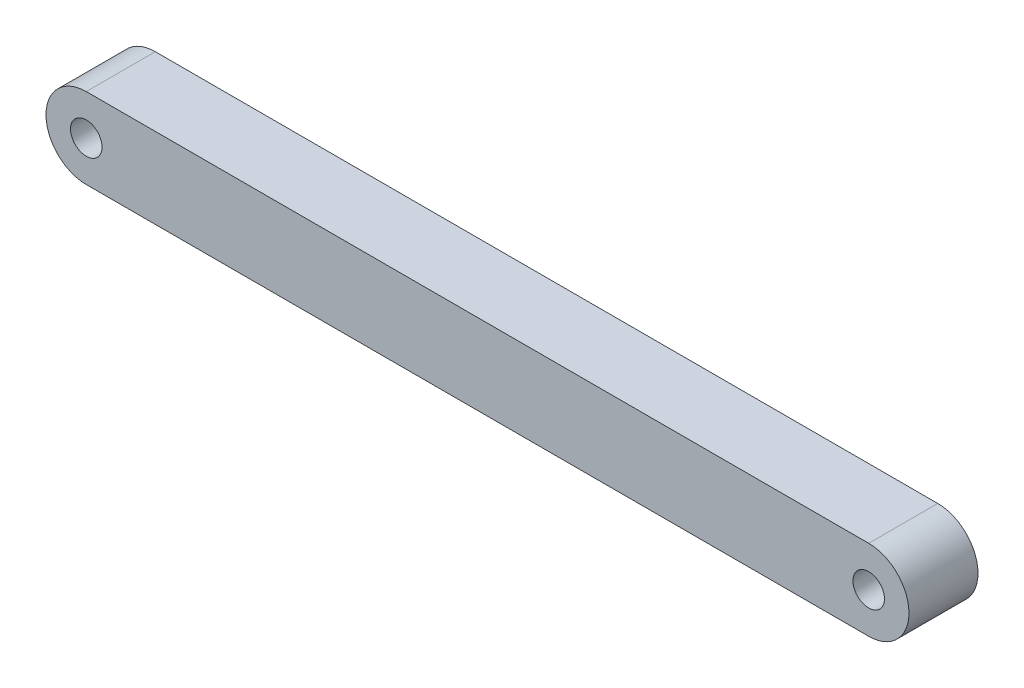
ISO-10303-21;
HEADER;
FILE_DESCRIPTION(('STEP AP214'),'2;1');
FILE_NAME('part.step','',(''),(''),'','','');
FILE_SCHEMA(('AUTOMOTIVE_DESIGN { 1 0 10303 214 1 1 1 1 }'));
ENDSEC;
DATA;
#1=APPLICATION_CONTEXT('core data for automotive mechanical design processes');
#2=APPLICATION_PROTOCOL_DEFINITION('international standard','automotive_design',2000,#1);
#3=PRODUCT_CONTEXT('',#1,'mechanical');
#4=PRODUCT('Part','Part','',(#3));
#5=PRODUCT_RELATED_PRODUCT_CATEGORY('part','',(#4));
#6=PRODUCT_DEFINITION_FORMATION('','',#4);
#7=PRODUCT_DEFINITION_CONTEXT('part definition',#1,'design');
#8=PRODUCT_DEFINITION('design','',#6,#7);
#9=PRODUCT_DEFINITION_SHAPE('','',#8);
#10=(LENGTH_UNIT() NAMED_UNIT(*) SI_UNIT(.MILLI.,.METRE.));
#11=(NAMED_UNIT(*) PLANE_ANGLE_UNIT() SI_UNIT($,.RADIAN.));
#12=(NAMED_UNIT(*) SI_UNIT($,.STERADIAN.) SOLID_ANGLE_UNIT());
#13=UNCERTAINTY_MEASURE_WITH_UNIT(LENGTH_MEASURE(1.E-05),#10,'distance_accuracy_value','');
#14=(GEOMETRIC_REPRESENTATION_CONTEXT(3) GLOBAL_UNCERTAINTY_ASSIGNED_CONTEXT((#13)) GLOBAL_UNIT_ASSIGNED_CONTEXT((#10,
#11,#12)) REPRESENTATION_CONTEXT('',''));
#15=CARTESIAN_POINT('',(0.,0.,0.));
#16=DIRECTION('',(0.,0.,1.));
#17=DIRECTION('',(1.,0.,0.));
#18=AXIS2_PLACEMENT_3D('',#15,#16,#17);
#19=CARTESIAN_POINT('',(0.,0.,7.62));
#20=DIRECTION('',(0.,0.,-1.));
#21=DIRECTION('',(-1.,0.,0.));
#22=AXIS2_PLACEMENT_3D('',#19,#20,#21);
#23=CYLINDRICAL_SURFACE('',#22,4.445);
#24=CARTESIAN_POINT('',(0.,0.,0.));
#25=DIRECTION('',(0.,0.,1.));
#26=DIRECTION('',(1.,0.,0.));
#27=AXIS2_PLACEMENT_3D('',#24,#25,#26);
#28=CIRCLE('',#27,4.445);
#29=CARTESIAN_POINT('',(0.,4.445,0.));
#30=VERTEX_POINT('',#29);
#31=CARTESIAN_POINT('',(0.,-4.445,0.));
#32=VERTEX_POINT('',#31);
#33=EDGE_CURVE('E95',#30,#32,#28,.T.);
#34=ORIENTED_EDGE('',*,*,#33,.T.);
#35=DIRECTION('',(0.,0.,-1.));
#36=VECTOR('',#35,1.);
#37=CARTESIAN_POINT('',(0.,-4.445,7.62));
#38=LINE('',#37,#36);
#39=CARTESIAN_POINT('',(0.,-4.445,7.62));
#40=VERTEX_POINT('',#39);
#41=EDGE_CURVE('E11',#40,#32,#38,.T.);
#42=ORIENTED_EDGE('',*,*,#41,.F.);
#43=CARTESIAN_POINT('',(0.,0.,7.62));
#44=DIRECTION('',(0.,0.,1.));
#45=DIRECTION('',(1.,0.,0.));
#46=AXIS2_PLACEMENT_3D('',#43,#44,#45);
#47=CIRCLE('',#46,4.445);
#48=CARTESIAN_POINT('',(0.,4.445,7.62));
#49=VERTEX_POINT('',#48);
#50=EDGE_CURVE('E83',#49,#40,#47,.T.);
#51=ORIENTED_EDGE('',*,*,#50,.F.);
#52=DIRECTION('',(0.,0.,-1.));
#53=VECTOR('',#52,1.);
#54=CARTESIAN_POINT('',(0.,4.445,7.62));
#55=LINE('',#54,#53);
#56=EDGE_CURVE('E91',#49,#30,#55,.T.);
#57=ORIENTED_EDGE('',*,*,#56,.T.);
#58=EDGE_LOOP('',(#34,#42,#51,#57));
#59=FACE_BOUND('',#58,.T.);
#60=ADVANCED_FACE('F32',(#59),#23,.T.);
#61=CARTESIAN_POINT('',(0.,-4.445,7.62));
#62=DIRECTION('',(0.,1.,0.));
#63=DIRECTION('',(0.,0.,1.));
#64=AXIS2_PLACEMENT_3D('',#61,#62,#63);
#65=PLANE('',#64);
#66=DIRECTION('',(1.,0.,0.));
#67=VECTOR('',#66,1.);
#68=CARTESIAN_POINT('',(0.,-4.445,0.));
#69=LINE('',#68,#67);
#70=CARTESIAN_POINT('',(86.36,-4.445,0.));
#71=VERTEX_POINT('',#70);
#72=EDGE_CURVE('E87',#32,#71,#69,.T.);
#73=ORIENTED_EDGE('',*,*,#72,.T.);
#74=DIRECTION('',(0.,0.,-1.));
#75=VECTOR('',#74,1.);
#76=CARTESIAN_POINT('',(86.36,-4.445,7.62));
#77=LINE('',#76,#75);
#78=CARTESIAN_POINT('',(86.36,-4.445,7.62));
#79=VERTEX_POINT('',#78);
#80=EDGE_CURVE('E40',#79,#71,#77,.T.);
#81=ORIENTED_EDGE('',*,*,#80,.F.);
#82=DIRECTION('',(1.,0.,0.));
#83=VECTOR('',#82,1.);
#84=CARTESIAN_POINT('',(0.,-4.445,7.62));
#85=LINE('',#84,#83);
#86=EDGE_CURVE('E78',#40,#79,#85,.T.);
#87=ORIENTED_EDGE('',*,*,#86,.F.);
#88=ORIENTED_EDGE('',*,*,#41,.T.);
#89=EDGE_LOOP('',(#73,#81,#87,#88));
#90=FACE_BOUND('',#89,.T.);
#91=ADVANCED_FACE('F86',(#90),#65,.F.);
#92=CARTESIAN_POINT('',(86.36,0.,7.62));
#93=DIRECTION('',(0.,0.,-1.));
#94=DIRECTION('',(-1.,0.,0.));
#95=AXIS2_PLACEMENT_3D('',#92,#93,#94);
#96=CYLINDRICAL_SURFACE('',#95,4.445);
#97=CARTESIAN_POINT('',(86.36,0.,0.));
#98=DIRECTION('',(0.,0.,1.));
#99=DIRECTION('',(1.,0.,0.));
#100=AXIS2_PLACEMENT_3D('',#97,#98,#99);
#101=CIRCLE('',#100,4.445);
#102=CARTESIAN_POINT('',(86.36,4.445,0.));
#103=VERTEX_POINT('',#102);
#104=EDGE_CURVE('E65',#71,#103,#101,.T.);
#105=ORIENTED_EDGE('',*,*,#104,.T.);
#106=DIRECTION('',(0.,0.,-1.));
#107=VECTOR('',#106,1.);
#108=CARTESIAN_POINT('',(86.36,4.445,7.62));
#109=LINE('',#108,#107);
#110=CARTESIAN_POINT('',(86.36,4.445,7.62));
#111=VERTEX_POINT('',#110);
#112=EDGE_CURVE('E88',#111,#103,#109,.T.);
#113=ORIENTED_EDGE('',*,*,#112,.F.);
#114=CARTESIAN_POINT('',(86.36,0.,7.62));
#115=DIRECTION('',(0.,0.,1.));
#116=DIRECTION('',(1.,0.,0.));
#117=AXIS2_PLACEMENT_3D('',#114,#115,#116);
#118=CIRCLE('',#117,4.445);
#119=EDGE_CURVE('E81',#79,#111,#118,.T.);
#120=ORIENTED_EDGE('',*,*,#119,.F.);
#121=ORIENTED_EDGE('',*,*,#80,.T.);
#122=EDGE_LOOP('',(#105,#113,#120,#121));
#123=FACE_BOUND('',#122,.T.);
#124=ADVANCED_FACE('F89',(#123),#96,.T.);
#125=CARTESIAN_POINT('',(0.,4.445,7.62));
#126=DIRECTION('',(0.,-1.,0.));
#127=DIRECTION('',(0.,0.,-1.));
#128=AXIS2_PLACEMENT_3D('',#125,#126,#127);
#129=PLANE('',#128);
#130=DIRECTION('',(-1.,0.,0.));
#131=VECTOR('',#130,1.);
#132=CARTESIAN_POINT('',(0.,4.445,0.));
#133=LINE('',#132,#131);
#134=EDGE_CURVE('E71',#103,#30,#133,.T.);
#135=ORIENTED_EDGE('',*,*,#134,.T.);
#136=ORIENTED_EDGE('',*,*,#56,.F.);
#137=DIRECTION('',(-1.,0.,0.));
#138=VECTOR('',#137,1.);
#139=CARTESIAN_POINT('',(0.,4.445,7.62));
#140=LINE('',#139,#138);
#141=EDGE_CURVE('E48',#111,#49,#140,.T.);
#142=ORIENTED_EDGE('',*,*,#141,.F.);
#143=ORIENTED_EDGE('',*,*,#112,.T.);
#144=EDGE_LOOP('',(#135,#136,#142,#143));
#145=FACE_BOUND('',#144,.T.);
#146=ADVANCED_FACE('F103',(#145),#129,.F.);
#147=CARTESIAN_POINT('',(0.,0.,7.62));
#148=DIRECTION('',(0.,0.,1.));
#149=DIRECTION('',(1.,0.,0.));
#150=AXIS2_PLACEMENT_3D('',#147,#148,#149);
#151=PLANE('',#150);
#152=CARTESIAN_POINT('',(86.36,0.,7.62));
#153=DIRECTION('',(0.,0.,1.));
#154=DIRECTION('',(1.,0.,0.));
#155=AXIS2_PLACEMENT_3D('',#152,#153,#154);
#156=CIRCLE('',#155,1.7399);
#157=CARTESIAN_POINT('',(88.0999,0.,7.62));
#158=VERTEX_POINT('',#157);
#159=EDGE_CURVE('E114',#158,#158,#156,.F.);
#160=ORIENTED_EDGE('',*,*,#159,.T.);
#161=EDGE_LOOP('',(#160));
#162=FACE_BOUND('',#161,.T.);
#163=CARTESIAN_POINT('',(0.,0.,7.62));
#164=DIRECTION('',(0.,0.,1.));
#165=DIRECTION('',(1.,0.,0.));
#166=AXIS2_PLACEMENT_3D('',#163,#164,#165);
#167=CIRCLE('',#166,1.7399);
#168=CARTESIAN_POINT('',(1.7399,0.,7.62));
#169=VERTEX_POINT('',#168);
#170=EDGE_CURVE('E98',#169,#169,#167,.T.);
#171=ORIENTED_EDGE('',*,*,#170,.F.);
#172=EDGE_LOOP('',(#171));
#173=FACE_BOUND('',#172,.T.);
#174=ORIENTED_EDGE('',*,*,#50,.T.);
#175=ORIENTED_EDGE('',*,*,#86,.T.);
#176=ORIENTED_EDGE('',*,*,#119,.T.);
#177=ORIENTED_EDGE('',*,*,#141,.T.);
#178=EDGE_LOOP('',(#174,#175,#176,#177));
#179=FACE_BOUND('',#178,.T.);
#180=ADVANCED_FACE('F79',(#162,#173,#179),#151,.T.);
#181=CARTESIAN_POINT('',(0.,0.,0.));
#182=DIRECTION('',(0.,0.,1.));
#183=DIRECTION('',(1.,0.,0.));
#184=AXIS2_PLACEMENT_3D('',#181,#182,#183);
#185=PLANE('',#184);
#186=CARTESIAN_POINT('',(86.36,0.,0.));
#187=DIRECTION('',(0.,0.,-1.));
#188=DIRECTION('',(-1.,0.,0.));
#189=AXIS2_PLACEMENT_3D('',#186,#187,#188);
#190=CIRCLE('',#189,1.7399);
#191=CARTESIAN_POINT('',(84.6201,0.,0.));
#192=VERTEX_POINT('',#191);
#193=EDGE_CURVE('E117',#192,#192,#190,.T.);
#194=ORIENTED_EDGE('',*,*,#193,.F.);
#195=EDGE_LOOP('',(#194));
#196=FACE_BOUND('',#195,.T.);
#197=CARTESIAN_POINT('',(0.,0.,0.));
#198=DIRECTION('',(0.,0.,1.));
#199=DIRECTION('',(1.,0.,0.));
#200=AXIS2_PLACEMENT_3D('',#197,#198,#199);
#201=CIRCLE('',#200,1.7399);
#202=CARTESIAN_POINT('',(1.7399,0.,0.));
#203=VERTEX_POINT('',#202);
#204=EDGE_CURVE('E111',#203,#203,#201,.T.);
#205=ORIENTED_EDGE('',*,*,#204,.T.);
#206=EDGE_LOOP('',(#205));
#207=FACE_BOUND('',#206,.T.);
#208=ORIENTED_EDGE('',*,*,#33,.F.);
#209=ORIENTED_EDGE('',*,*,#134,.F.);
#210=ORIENTED_EDGE('',*,*,#104,.F.);
#211=ORIENTED_EDGE('',*,*,#72,.F.);
#212=EDGE_LOOP('',(#208,#209,#210,#211));
#213=FACE_BOUND('',#212,.T.);
#214=ADVANCED_FACE('F106',(#196,#207,#213),#185,.F.);
#215=CARTESIAN_POINT('',(0.,0.,0.));
#216=DIRECTION('',(0.,0.,1.));
#217=DIRECTION('',(1.,0.,0.));
#218=AXIS2_PLACEMENT_3D('',#215,#216,#217);
#219=CYLINDRICAL_SURFACE('',#218,1.7399);
#220=ORIENTED_EDGE('',*,*,#170,.T.);
#221=EDGE_LOOP('',(#220));
#222=FACE_BOUND('',#221,.T.);
#223=ORIENTED_EDGE('',*,*,#204,.F.);
#224=EDGE_LOOP('',(#223));
#225=FACE_BOUND('',#224,.T.);
#226=ADVANCED_FACE('F125',(#222,#225),#219,.F.);
#227=CARTESIAN_POINT('',(86.36,0.,0.));
#228=DIRECTION('',(0.,0.,1.));
#229=DIRECTION('',(1.,0.,0.));
#230=AXIS2_PLACEMENT_3D('',#227,#228,#229);
#231=CYLINDRICAL_SURFACE('',#230,1.7399);
#232=ORIENTED_EDGE('',*,*,#159,.F.);
#233=EDGE_LOOP('',(#232));
#234=FACE_BOUND('',#233,.T.);
#235=ORIENTED_EDGE('',*,*,#193,.T.);
#236=EDGE_LOOP('',(#235));
#237=FACE_BOUND('',#236,.T.);
#238=ADVANCED_FACE('F121',(#234,#237),#231,.F.);
#239=CLOSED_SHELL('',(#60,#91,#124,#146,#180,#214,#226,#238));
#240=MANIFOLD_SOLID_BREP('B2',#239);
#241=ADVANCED_BREP_SHAPE_REPRESENTATION('',(#18,#240),#14);
#242=SHAPE_DEFINITION_REPRESENTATION(#9,#241);
ENDSEC;
END-ISO-10303-21;
